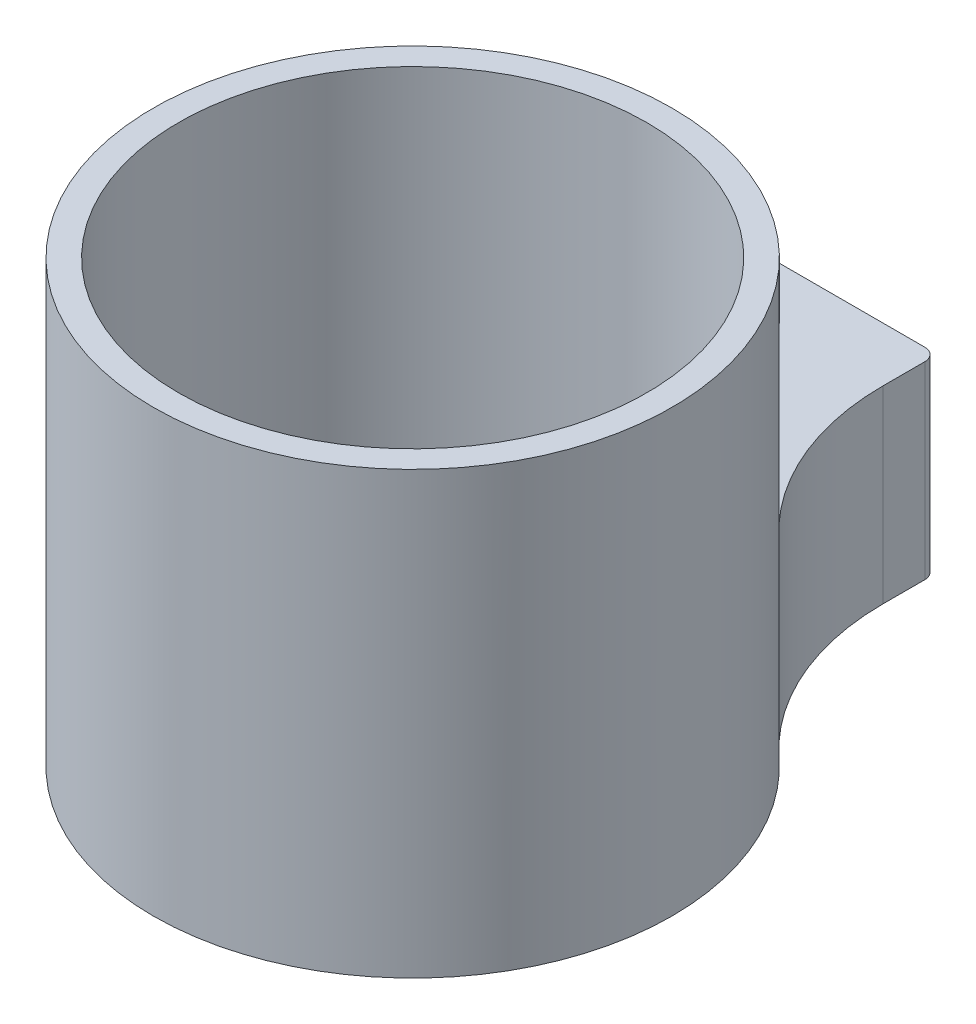
ISO-10303-21;
HEADER;
FILE_DESCRIPTION(('STEP AP214'),'2;1');
FILE_NAME('part.step','',(''),(''),'','','');
FILE_SCHEMA(('AUTOMOTIVE_DESIGN { 1 0 10303 214 1 1 1 1 }'));
ENDSEC;
DATA;
#1=APPLICATION_CONTEXT('core data for automotive mechanical design processes');
#2=APPLICATION_PROTOCOL_DEFINITION('international standard','automotive_design',2000,#1);
#3=PRODUCT_CONTEXT('',#1,'mechanical');
#4=PRODUCT('Part','Part','',(#3));
#5=PRODUCT_RELATED_PRODUCT_CATEGORY('part','',(#4));
#6=PRODUCT_DEFINITION_FORMATION('','',#4);
#7=PRODUCT_DEFINITION_CONTEXT('part definition',#1,'design');
#8=PRODUCT_DEFINITION('design','',#6,#7);
#9=PRODUCT_DEFINITION_SHAPE('','',#8);
#10=(LENGTH_UNIT() NAMED_UNIT(*) SI_UNIT(.MILLI.,.METRE.));
#11=(NAMED_UNIT(*) PLANE_ANGLE_UNIT() SI_UNIT($,.RADIAN.));
#12=(NAMED_UNIT(*) SI_UNIT($,.STERADIAN.) SOLID_ANGLE_UNIT());
#13=UNCERTAINTY_MEASURE_WITH_UNIT(LENGTH_MEASURE(1.E-05),#10,'distance_accuracy_value','');
#14=(GEOMETRIC_REPRESENTATION_CONTEXT(3) GLOBAL_UNCERTAINTY_ASSIGNED_CONTEXT((#13)) GLOBAL_UNIT_ASSIGNED_CONTEXT((#10,
#11,#12)) REPRESENTATION_CONTEXT('',''));
#15=CARTESIAN_POINT('',(0.,0.,0.));
#16=DIRECTION('',(0.,0.,1.));
#17=DIRECTION('',(1.,0.,0.));
#18=AXIS2_PLACEMENT_3D('',#15,#16,#17);
#19=CARTESIAN_POINT('',(7.5,-7.5,15.));
#20=DIRECTION('',(-1.,0.,0.));
#21=DIRECTION('',(0.,0.,1.));
#22=AXIS2_PLACEMENT_3D('',#19,#20,#21);
#23=PLANE('',#22);
#24=DIRECTION('',(0.,0.,-1.));
#25=VECTOR('',#24,1.);
#26=CARTESIAN_POINT('',(7.5,-7.5,15.));
#27=LINE('',#26,#25);
#28=CARTESIAN_POINT('',(7.5,-7.5,4.31798242665095));
#29=VERTEX_POINT('',#28);
#30=CARTESIAN_POINT('',(7.5,-7.5,1.));
#31=VERTEX_POINT('',#30);
#32=EDGE_CURVE('E144',#29,#31,#27,.T.);
#33=ORIENTED_EDGE('',*,*,#32,.T.);
#34=DIRECTION('',(0.,1.,0.));
#35=VECTOR('',#34,1.);
#36=CARTESIAN_POINT('',(7.5,7.5,1.));
#37=LINE('',#36,#35);
#38=CARTESIAN_POINT('',(7.5,7.5,1.));
#39=VERTEX_POINT('',#38);
#40=EDGE_CURVE('E11',#31,#39,#37,.T.);
#41=ORIENTED_EDGE('',*,*,#40,.T.);
#42=DIRECTION('',(0.,0.,-1.));
#43=VECTOR('',#42,1.);
#44=CARTESIAN_POINT('',(7.5,7.5,15.));
#45=LINE('',#44,#43);
#46=CARTESIAN_POINT('',(7.5,7.5,4.31798242665095));
#47=VERTEX_POINT('',#46);
#48=EDGE_CURVE('E156',#47,#39,#45,.T.);
#49=ORIENTED_EDGE('',*,*,#48,.F.);
#50=DIRECTION('',(0.,1.,0.));
#51=VECTOR('',#50,1.);
#52=CARTESIAN_POINT('',(7.5,-7.5,4.31798242665095));
#53=LINE('',#52,#51);
#54=EDGE_CURVE('E170',#47,#29,#53,.F.);
#55=ORIENTED_EDGE('',*,*,#54,.T.);
#56=EDGE_LOOP('',(#33,#41,#49,#55));
#57=FACE_BOUND('',#56,.T.);
#58=ADVANCED_FACE('F46',(#57),#23,.F.);
#59=CARTESIAN_POINT('',(-7.5,7.5,15.));
#60=DIRECTION('',(0.,-1.,0.));
#61=DIRECTION('',(0.,0.,-1.));
#62=AXIS2_PLACEMENT_3D('',#59,#60,#61);
#63=PLANE('',#62);
#64=CARTESIAN_POINT('',(6.,7.5,13.5403701301622));
#65=DIRECTION('',(0.,1.,0.));
#66=DIRECTION('',(0.,0.,1.));
#67=AXIS2_PLACEMENT_3D('',#64,#65,#66);
#68=CIRCLE('',#67,0.499999999999988);
#69=CARTESIAN_POINT('',(6.,7.5,14.0403701301622));
#70=VERTEX_POINT('',#69);
#71=EDGE_CURVE('E316',#70,#70,#68,.T.);
#72=ORIENTED_EDGE('',*,*,#71,.F.);
#73=EDGE_LOOP('',(#72));
#74=FACE_BOUND('',#73,.T.);
#75=DIRECTION('',(-1.,0.,0.));
#76=VECTOR('',#75,1.);
#77=CARTESIAN_POINT('',(-7.5,7.5,0.));
#78=LINE('',#77,#76);
#79=CARTESIAN_POINT('',(6.5,7.5,0.));
#80=VERTEX_POINT('',#79);
#81=CARTESIAN_POINT('',(-6.5,7.5,0.));
#82=VERTEX_POINT('',#81);
#83=EDGE_CURVE('E126',#80,#82,#78,.T.);
#84=ORIENTED_EDGE('',*,*,#83,.T.);
#85=CARTESIAN_POINT('',(-6.5,7.5,1.));
#86=DIRECTION('',(0.,-1.,0.));
#87=DIRECTION('',(0.,0.,-1.));
#88=AXIS2_PLACEMENT_3D('',#85,#86,#87);
#89=CIRCLE('',#88,1.);
#90=CARTESIAN_POINT('',(-7.5,7.5,1.));
#91=VERTEX_POINT('',#90);
#92=EDGE_CURVE('E55',#82,#91,#89,.F.);
#93=ORIENTED_EDGE('',*,*,#92,.T.);
#94=DIRECTION('',(0.,0.,-1.));
#95=VECTOR('',#94,1.);
#96=CARTESIAN_POINT('',(-7.5,7.5,15.));
#97=LINE('',#96,#95);
#98=CARTESIAN_POINT('',(-7.5,7.5,4.31798242665095));
#99=VERTEX_POINT('',#98);
#100=EDGE_CURVE('E152',#99,#91,#97,.T.);
#101=ORIENTED_EDGE('',*,*,#100,.F.);
#102=CARTESIAN_POINT('',(-27.5,7.5,4.31798242665095));
#103=DIRECTION('',(0.,-1.,0.));
#104=DIRECTION('',(0.,0.,-1.));
#105=AXIS2_PLACEMENT_3D('',#102,#103,#104);
#106=CIRCLE('',#105,20.);
#107=CARTESIAN_POINT('',(-13.9532019704434,7.5,19.031386626441));
#108=VERTEX_POINT('',#107);
#109=EDGE_CURVE('E176',#99,#108,#106,.T.);
#110=ORIENTED_EDGE('',*,*,#109,.T.);
#111=CARTESIAN_POINT('',(0.,7.5,34.1861929522248));
#112=DIRECTION('',(0.,-1.,0.));
#113=DIRECTION('',(0.,0.,-1.));
#114=AXIS2_PLACEMENT_3D('',#111,#112,#113);
#115=CIRCLE('',#114,20.6);
#116=CARTESIAN_POINT('',(13.9532019704434,7.5,19.031386626441));
#117=VERTEX_POINT('',#116);
#118=EDGE_CURVE('E137',#108,#117,#115,.T.);
#119=ORIENTED_EDGE('',*,*,#118,.T.);
#120=CARTESIAN_POINT('',(27.5,7.5,4.31798242665095));
#121=DIRECTION('',(0.,-1.,0.));
#122=DIRECTION('',(0.,0.,-1.));
#123=AXIS2_PLACEMENT_3D('',#120,#121,#122);
#124=CIRCLE('',#123,20.);
#125=EDGE_CURVE('E180',#117,#47,#124,.T.);
#126=ORIENTED_EDGE('',*,*,#125,.T.);
#127=ORIENTED_EDGE('',*,*,#48,.T.);
#128=CARTESIAN_POINT('',(6.5,7.5,1.));
#129=DIRECTION('',(0.,-1.,0.));
#130=DIRECTION('',(0.,0.,-1.));
#131=AXIS2_PLACEMENT_3D('',#128,#129,#130);
#132=CIRCLE('',#131,1.);
#133=EDGE_CURVE('E62',#39,#80,#132,.F.);
#134=ORIENTED_EDGE('',*,*,#133,.T.);
#135=EDGE_LOOP('',(#84,#93,#101,#110,#119,#126,#127,#134));
#136=FACE_BOUND('',#135,.T.);
#137=ADVANCED_FACE('F207',(#74,#136),#63,.F.);
#138=CARTESIAN_POINT('',(-7.5,-7.5,15.));
#139=DIRECTION('',(1.,0.,0.));
#140=DIRECTION('',(0.,0.,-1.));
#141=AXIS2_PLACEMENT_3D('',#138,#139,#140);
#142=PLANE('',#141);
#143=ORIENTED_EDGE('',*,*,#100,.T.);
#144=DIRECTION('',(0.,-1.,0.));
#145=VECTOR('',#144,1.);
#146=CARTESIAN_POINT('',(-7.5,-7.5,1.));
#147=LINE('',#146,#145);
#148=CARTESIAN_POINT('',(-7.5,-7.5,1.));
#149=VERTEX_POINT('',#148);
#150=EDGE_CURVE('E185',#91,#149,#147,.T.);
#151=ORIENTED_EDGE('',*,*,#150,.T.);
#152=DIRECTION('',(0.,0.,-1.));
#153=VECTOR('',#152,1.);
#154=CARTESIAN_POINT('',(-7.5,-7.5,15.));
#155=LINE('',#154,#153);
#156=CARTESIAN_POINT('',(-7.5,-7.5,4.31798242665095));
#157=VERTEX_POINT('',#156);
#158=EDGE_CURVE('E148',#157,#149,#155,.T.);
#159=ORIENTED_EDGE('',*,*,#158,.F.);
#160=DIRECTION('',(0.,1.,0.));
#161=VECTOR('',#160,1.);
#162=CARTESIAN_POINT('',(-7.5,-7.5,4.31798242665095));
#163=LINE('',#162,#161);
#164=EDGE_CURVE('E167',#157,#99,#163,.T.);
#165=ORIENTED_EDGE('',*,*,#164,.T.);
#166=EDGE_LOOP('',(#143,#151,#159,#165));
#167=FACE_BOUND('',#166,.T.);
#168=ADVANCED_FACE('F212',(#167),#142,.F.);
#169=CARTESIAN_POINT('',(-7.5,-7.5,15.));
#170=DIRECTION('',(0.,1.,0.));
#171=DIRECTION('',(0.,0.,1.));
#172=AXIS2_PLACEMENT_3D('',#169,#170,#171);
#173=PLANE('',#172);
#174=CARTESIAN_POINT('',(6.,-7.5,13.5403701301622));
#175=DIRECTION('',(0.,1.,0.));
#176=DIRECTION('',(0.,0.,1.));
#177=AXIS2_PLACEMENT_3D('',#174,#175,#176);
#178=CIRCLE('',#177,0.499999999999997);
#179=CARTESIAN_POINT('',(6.,-7.5,14.0403701301622));
#180=VERTEX_POINT('',#179);
#181=EDGE_CURVE('E245',#180,#180,#178,.T.);
#182=ORIENTED_EDGE('',*,*,#181,.T.);
#183=EDGE_LOOP('',(#182));
#184=FACE_BOUND('',#183,.T.);
#185=ORIENTED_EDGE('',*,*,#158,.T.);
#186=CARTESIAN_POINT('',(-6.5,-7.5,1.));
#187=DIRECTION('',(0.,1.,0.));
#188=DIRECTION('',(0.,0.,1.));
#189=AXIS2_PLACEMENT_3D('',#186,#187,#188);
#190=CIRCLE('',#189,1.);
#191=CARTESIAN_POINT('',(-6.5,-7.5,0.));
#192=VERTEX_POINT('',#191);
#193=EDGE_CURVE('E192',#149,#192,#190,.F.);
#194=ORIENTED_EDGE('',*,*,#193,.T.);
#195=DIRECTION('',(1.,0.,0.));
#196=VECTOR('',#195,1.);
#197=CARTESIAN_POINT('',(-7.5,-7.5,0.));
#198=LINE('',#197,#196);
#199=CARTESIAN_POINT('',(6.5,-7.5,0.));
#200=VERTEX_POINT('',#199);
#201=EDGE_CURVE('E133',#192,#200,#198,.T.);
#202=ORIENTED_EDGE('',*,*,#201,.T.);
#203=CARTESIAN_POINT('',(6.5,-7.5,1.));
#204=DIRECTION('',(0.,1.,0.));
#205=DIRECTION('',(0.,0.,1.));
#206=AXIS2_PLACEMENT_3D('',#203,#204,#205);
#207=CIRCLE('',#206,1.);
#208=EDGE_CURVE('E189',#200,#31,#207,.F.);
#209=ORIENTED_EDGE('',*,*,#208,.T.);
#210=ORIENTED_EDGE('',*,*,#32,.F.);
#211=CARTESIAN_POINT('',(27.5,-7.5,4.31798242665095));
#212=DIRECTION('',(0.,1.,0.));
#213=DIRECTION('',(0.,0.,1.));
#214=AXIS2_PLACEMENT_3D('',#211,#212,#213);
#215=CIRCLE('',#214,20.);
#216=CARTESIAN_POINT('',(13.9532019704434,-7.5,19.031386626441));
#217=VERTEX_POINT('',#216);
#218=EDGE_CURVE('E183',#29,#217,#215,.T.);
#219=ORIENTED_EDGE('',*,*,#218,.T.);
#220=CARTESIAN_POINT('',(0.,-7.5,34.1861929522248));
#221=DIRECTION('',(0.,1.,0.));
#222=DIRECTION('',(0.,0.,1.));
#223=AXIS2_PLACEMENT_3D('',#220,#221,#222);
#224=CIRCLE('',#223,20.6);
#225=CARTESIAN_POINT('',(-13.9532019704434,-7.5,19.031386626441));
#226=VERTEX_POINT('',#225);
#227=EDGE_CURVE('E231',#226,#217,#224,.T.);
#228=ORIENTED_EDGE('',*,*,#227,.F.);
#229=CARTESIAN_POINT('',(-27.5,-7.5,4.31798242665095));
#230=DIRECTION('',(0.,1.,0.));
#231=DIRECTION('',(0.,0.,1.));
#232=AXIS2_PLACEMENT_3D('',#229,#230,#231);
#233=CIRCLE('',#232,20.);
#234=EDGE_CURVE('E173',#226,#157,#233,.T.);
#235=ORIENTED_EDGE('',*,*,#234,.T.);
#236=EDGE_LOOP('',(#185,#194,#202,#209,#210,#219,#228,#235));
#237=FACE_BOUND('',#236,.T.);
#238=CARTESIAN_POINT('',(0.,-7.5,34.1861929522248));
#239=DIRECTION('',(0.,1.,0.));
#240=DIRECTION('',(0.,0.,1.));
#241=AXIS2_PLACEMENT_3D('',#238,#239,#240);
#242=CIRCLE('',#241,16.);
#243=CARTESIAN_POINT('',(0.,-7.5,50.1861929522248));
#244=VERTEX_POINT('',#243);
#245=EDGE_CURVE('E236',#244,#244,#242,.T.);
#246=ORIENTED_EDGE('',*,*,#245,.T.);
#247=EDGE_LOOP('',(#246));
#248=FACE_BOUND('',#247,.T.);
#249=ADVANCED_FACE('F217',(#184,#237,#248),#173,.F.);
#250=CARTESIAN_POINT('',(0.,0.,0.));
#251=DIRECTION('',(0.,0.,-1.));
#252=DIRECTION('',(-1.,0.,0.));
#253=AXIS2_PLACEMENT_3D('',#250,#251,#252);
#254=PLANE('',#253);
#255=CARTESIAN_POINT('',(0.,0.,0.));
#256=DIRECTION('',(0.,0.,-1.));
#257=DIRECTION('',(-1.,0.,0.));
#258=AXIS2_PLACEMENT_3D('',#255,#256,#257);
#259=CIRCLE('',#258,3.2);
#260=CARTESIAN_POINT('',(-3.2,0.,0.));
#261=VERTEX_POINT('',#260);
#262=EDGE_CURVE('E127',#261,#261,#259,.T.);
#263=ORIENTED_EDGE('',*,*,#262,.F.);
#264=EDGE_LOOP('',(#263));
#265=FACE_BOUND('',#264,.T.);
#266=ORIENTED_EDGE('',*,*,#201,.F.);
#267=DIRECTION('',(0.,-1.,0.));
#268=VECTOR('',#267,1.);
#269=CARTESIAN_POINT('',(-6.5,7.5,0.));
#270=LINE('',#269,#268);
#271=EDGE_CURVE('E69',#192,#82,#270,.F.);
#272=ORIENTED_EDGE('',*,*,#271,.T.);
#273=ORIENTED_EDGE('',*,*,#83,.F.);
#274=DIRECTION('',(0.,1.,0.));
#275=VECTOR('',#274,1.);
#276=CARTESIAN_POINT('',(6.5,-7.5,0.));
#277=LINE('',#276,#275);
#278=EDGE_CURVE('E195',#80,#200,#277,.F.);
#279=ORIENTED_EDGE('',*,*,#278,.T.);
#280=EDGE_LOOP('',(#266,#272,#273,#279));
#281=FACE_BOUND('',#280,.T.);
#282=ADVANCED_FACE('F119',(#265,#281),#254,.T.);
#283=CARTESIAN_POINT('',(0.,0.,10.));
#284=DIRECTION('',(0.,0.,-1.));
#285=DIRECTION('',(-1.,0.,0.));
#286=AXIS2_PLACEMENT_3D('',#283,#284,#285);
#287=CONICAL_SURFACE('',#286,3.2,1.02974425867665);
#288=CARTESIAN_POINT('',(0.,0.,11.9227539808882));
#289=VERTEX_POINT('',#288);
#290=VERTEX_LOOP('',#289);
#291=FACE_BOUND('',#290,.T.);
#292=CARTESIAN_POINT('',(0.,0.,10.));
#293=DIRECTION('',(0.,0.,-1.));
#294=DIRECTION('',(-1.,0.,0.));
#295=AXIS2_PLACEMENT_3D('',#292,#293,#294);
#296=CIRCLE('',#295,3.2);
#297=CARTESIAN_POINT('',(-3.2,0.,10.));
#298=VERTEX_POINT('',#297);
#299=EDGE_CURVE('E123',#298,#298,#296,.T.);
#300=ORIENTED_EDGE('',*,*,#299,.T.);
#301=EDGE_LOOP('',(#300));
#302=FACE_BOUND('',#301,.T.);
#303=ADVANCED_FACE('F115',(#291,#302),#287,.F.);
#304=CARTESIAN_POINT('',(0.,0.,0.));
#305=DIRECTION('',(0.,0.,-1.));
#306=DIRECTION('',(-1.,0.,0.));
#307=AXIS2_PLACEMENT_3D('',#304,#305,#306);
#308=CYLINDRICAL_SURFACE('',#307,3.2);
#309=ORIENTED_EDGE('',*,*,#299,.F.);
#310=EDGE_LOOP('',(#309));
#311=FACE_BOUND('',#310,.T.);
#312=ORIENTED_EDGE('',*,*,#262,.T.);
#313=EDGE_LOOP('',(#312));
#314=FACE_BOUND('',#313,.T.);
#315=ADVANCED_FACE('F118',(#311,#314),#308,.F.);
#316=CARTESIAN_POINT('',(0.,-2.5,34.1861929522248));
#317=DIRECTION('',(0.,1.,0.));
#318=DIRECTION('',(0.,0.,1.));
#319=AXIS2_PLACEMENT_3D('',#316,#317,#318);
#320=CYLINDRICAL_SURFACE('',#319,20.6);
#321=CARTESIAN_POINT('',(0.,27.5,34.1861929522248));
#322=DIRECTION('',(0.,1.,0.));
#323=DIRECTION('',(0.,0.,1.));
#324=AXIS2_PLACEMENT_3D('',#321,#322,#323);
#325=CIRCLE('',#324,20.6);
#326=CARTESIAN_POINT('',(0.,27.5,54.7861929522248));
#327=VERTEX_POINT('',#326);
#328=EDGE_CURVE('E252',#327,#327,#325,.T.);
#329=ORIENTED_EDGE('',*,*,#328,.F.);
#330=EDGE_LOOP('',(#329));
#331=FACE_BOUND('',#330,.T.);
#332=ORIENTED_EDGE('',*,*,#118,.F.);
#333=DIRECTION('',(0.,1.,0.));
#334=VECTOR('',#333,1.);
#335=CARTESIAN_POINT('',(-13.9532019704434,-2.5,19.031386626441));
#336=LINE('',#335,#334);
#337=EDGE_CURVE('E163',#108,#226,#336,.F.);
#338=ORIENTED_EDGE('',*,*,#337,.T.);
#339=ORIENTED_EDGE('',*,*,#227,.T.);
#340=DIRECTION('',(0.,1.,0.));
#341=VECTOR('',#340,1.);
#342=CARTESIAN_POINT('',(13.9532019704434,-2.5,19.031386626441));
#343=LINE('',#342,#341);
#344=EDGE_CURVE('E159',#217,#117,#343,.T.);
#345=ORIENTED_EDGE('',*,*,#344,.T.);
#346=EDGE_LOOP('',(#332,#338,#339,#345));
#347=FACE_BOUND('',#346,.T.);
#348=ADVANCED_FACE('F233',(#331,#347),#320,.T.);
#349=CARTESIAN_POINT('',(0.,-2.5,34.1861929522248));
#350=DIRECTION('',(0.,1.,0.));
#351=DIRECTION('',(0.,0.,1.));
#352=AXIS2_PLACEMENT_3D('',#349,#350,#351);
#353=CYLINDRICAL_SURFACE('',#352,18.6);
#354=CARTESIAN_POINT('',(0.,-2.5,34.1861929522248));
#355=DIRECTION('',(0.,1.,0.));
#356=DIRECTION('',(0.,0.,1.));
#357=AXIS2_PLACEMENT_3D('',#354,#355,#356);
#358=CIRCLE('',#357,18.6);
#359=CARTESIAN_POINT('',(0.,-2.5,52.7861929522248));
#360=VERTEX_POINT('',#359);
#361=EDGE_CURVE('E256',#360,#360,#358,.T.);
#362=ORIENTED_EDGE('',*,*,#361,.F.);
#363=EDGE_LOOP('',(#362));
#364=FACE_BOUND('',#363,.T.);
#365=CARTESIAN_POINT('',(0.,27.5,34.1861929522248));
#366=DIRECTION('',(0.,1.,0.));
#367=DIRECTION('',(0.,0.,1.));
#368=AXIS2_PLACEMENT_3D('',#365,#366,#367);
#369=CIRCLE('',#368,18.6);
#370=CARTESIAN_POINT('',(0.,27.5,52.7861929522248));
#371=VERTEX_POINT('',#370);
#372=EDGE_CURVE('E242',#371,#371,#369,.T.);
#373=ORIENTED_EDGE('',*,*,#372,.T.);
#374=EDGE_LOOP('',(#373));
#375=FACE_BOUND('',#374,.T.);
#376=ADVANCED_FACE('F292',(#364,#375),#353,.F.);
#377=CARTESIAN_POINT('',(0.,27.5,34.1861929522248));
#378=DIRECTION('',(0.,1.,0.));
#379=DIRECTION('',(0.,0.,1.));
#380=AXIS2_PLACEMENT_3D('',#377,#378,#379);
#381=PLANE('',#380);
#382=ORIENTED_EDGE('',*,*,#328,.T.);
#383=EDGE_LOOP('',(#382));
#384=FACE_BOUND('',#383,.T.);
#385=ORIENTED_EDGE('',*,*,#372,.F.);
#386=EDGE_LOOP('',(#385));
#387=FACE_BOUND('',#386,.T.);
#388=ADVANCED_FACE('F296',(#384,#387),#381,.T.);
#389=CARTESIAN_POINT('',(0.,-2.5,34.1861929522248));
#390=DIRECTION('',(0.,-1.,0.));
#391=DIRECTION('',(0.,0.,-1.));
#392=AXIS2_PLACEMENT_3D('',#389,#390,#391);
#393=PLANE('',#392);
#394=CARTESIAN_POINT('',(0.,-2.5,34.1861929522248));
#395=DIRECTION('',(0.,-1.,0.));
#396=DIRECTION('',(0.,0.,-1.));
#397=AXIS2_PLACEMENT_3D('',#394,#395,#396);
#398=CIRCLE('',#397,16.);
#399=CARTESIAN_POINT('',(0.,-2.5,50.1861929522248));
#400=VERTEX_POINT('',#399);
#401=EDGE_CURVE('E237',#400,#400,#398,.T.);
#402=ORIENTED_EDGE('',*,*,#401,.T.);
#403=EDGE_LOOP('',(#402));
#404=FACE_BOUND('',#403,.T.);
#405=ORIENTED_EDGE('',*,*,#361,.T.);
#406=EDGE_LOOP('',(#405));
#407=FACE_BOUND('',#406,.T.);
#408=ADVANCED_FACE('F270',(#404,#407),#393,.F.);
#409=CARTESIAN_POINT('',(0.,-64.774611737066,34.1861929522248));
#410=DIRECTION('',(0.,1.,0.));
#411=DIRECTION('',(0.,0.,1.));
#412=AXIS2_PLACEMENT_3D('',#409,#410,#411);
#413=CYLINDRICAL_SURFACE('',#412,16.);
#414=CARTESIAN_POINT('',(0.,-7.5,50.1861929522248));
#415=CARTESIAN_POINT('',(0.,-7.44791666666667,50.1861929522248));
#416=CARTESIAN_POINT('',(0.,-7.39583333333333,50.1861929522248));
#417=CARTESIAN_POINT('',(0.,-7.29166666666667,50.1861929522248));
#418=CARTESIAN_POINT('',(0.,-7.23958333333333,50.1861929522248));
#419=CARTESIAN_POINT('',(0.,-7.13541666666667,50.1861929522248));
#420=CARTESIAN_POINT('',(0.,-7.08333333333333,50.1861929522248));
#421=CARTESIAN_POINT('',(0.,-6.97916666666666,50.1861929522248));
#422=CARTESIAN_POINT('',(0.,-6.92708333333333,50.1861929522248));
#423=CARTESIAN_POINT('',(0.,-6.82291666666667,50.1861929522248));
#424=CARTESIAN_POINT('',(0.,-6.77083333333333,50.1861929522248));
#425=CARTESIAN_POINT('',(0.,-6.66666666666667,50.1861929522248));
#426=CARTESIAN_POINT('',(0.,-6.61458333333333,50.1861929522248));
#427=CARTESIAN_POINT('',(0.,-6.51041666666666,50.1861929522248));
#428=CARTESIAN_POINT('',(0.,-6.45833333333333,50.1861929522248));
#429=CARTESIAN_POINT('',(0.,-6.35416666666666,50.1861929522248));
#430=CARTESIAN_POINT('',(0.,-6.30208333333333,50.1861929522248));
#431=CARTESIAN_POINT('',(0.,-6.19791666666667,50.1861929522248));
#432=CARTESIAN_POINT('',(0.,-6.14583333333333,50.1861929522248));
#433=CARTESIAN_POINT('',(0.,-6.04166666666667,50.1861929522248));
#434=CARTESIAN_POINT('',(0.,-5.98958333333333,50.1861929522248));
#435=CARTESIAN_POINT('',(0.,-5.88541666666666,50.1861929522248));
#436=CARTESIAN_POINT('',(0.,-5.83333333333333,50.1861929522248));
#437=CARTESIAN_POINT('',(0.,-5.72916666666666,50.1861929522248));
#438=CARTESIAN_POINT('',(0.,-5.67708333333333,50.1861929522248));
#439=CARTESIAN_POINT('',(0.,-5.57291666666667,50.1861929522248));
#440=CARTESIAN_POINT('',(0.,-5.52083333333333,50.1861929522248));
#441=CARTESIAN_POINT('',(0.,-5.41666666666667,50.1861929522248));
#442=CARTESIAN_POINT('',(0.,-5.36458333333333,50.1861929522248));
#443=CARTESIAN_POINT('',(0.,-5.26041666666666,50.1861929522248));
#444=CARTESIAN_POINT('',(0.,-5.20833333333333,50.1861929522248));
#445=CARTESIAN_POINT('',(0.,-5.10416666666666,50.1861929522248));
#446=CARTESIAN_POINT('',(0.,-5.05208333333333,50.1861929522248));
#447=CARTESIAN_POINT('',(0.,-4.94791666666667,50.1861929522248));
#448=CARTESIAN_POINT('',(0.,-4.89583333333333,50.1861929522248));
#449=CARTESIAN_POINT('',(0.,-4.79166666666667,50.1861929522248));
#450=CARTESIAN_POINT('',(0.,-4.73958333333333,50.1861929522248));
#451=CARTESIAN_POINT('',(0.,-4.63541666666666,50.1861929522248));
#452=CARTESIAN_POINT('',(0.,-4.58333333333333,50.1861929522248));
#453=CARTESIAN_POINT('',(0.,-4.47916666666666,50.1861929522248));
#454=CARTESIAN_POINT('',(0.,-4.42708333333333,50.1861929522248));
#455=CARTESIAN_POINT('',(0.,-4.32291666666667,50.1861929522248));
#456=CARTESIAN_POINT('',(0.,-4.27083333333333,50.1861929522248));
#457=CARTESIAN_POINT('',(0.,-4.16666666666667,50.1861929522248));
#458=CARTESIAN_POINT('',(0.,-4.11458333333333,50.1861929522248));
#459=CARTESIAN_POINT('',(0.,-4.01041666666666,50.1861929522248));
#460=CARTESIAN_POINT('',(0.,-3.95833333333333,50.1861929522248));
#461=CARTESIAN_POINT('',(0.,-3.85416666666666,50.1861929522248));
#462=CARTESIAN_POINT('',(0.,-3.80208333333333,50.1861929522248));
#463=CARTESIAN_POINT('',(0.,-3.69791666666666,50.1861929522248));
#464=CARTESIAN_POINT('',(0.,-3.64583333333333,50.1861929522248));
#465=CARTESIAN_POINT('',(0.,-3.54166666666667,50.1861929522248));
#466=CARTESIAN_POINT('',(0.,-3.48958333333333,50.1861929522248));
#467=CARTESIAN_POINT('',(0.,-3.38541666666666,50.1861929522248));
#468=CARTESIAN_POINT('',(0.,-3.33333333333333,50.1861929522248));
#469=CARTESIAN_POINT('',(0.,-3.22916666666666,50.1861929522248));
#470=CARTESIAN_POINT('',(0.,-3.17708333333333,50.1861929522248));
#471=CARTESIAN_POINT('',(0.,-3.07291666666666,50.1861929522248));
#472=CARTESIAN_POINT('',(0.,-3.02083333333333,50.1861929522248));
#473=CARTESIAN_POINT('',(0.,-2.91666666666666,50.1861929522248));
#474=CARTESIAN_POINT('',(0.,-2.86458333333333,50.1861929522248));
#475=CARTESIAN_POINT('',(0.,-2.76041666666666,50.1861929522248));
#476=CARTESIAN_POINT('',(0.,-2.70833333333333,50.1861929522248));
#477=CARTESIAN_POINT('',(0.,-2.60416666666666,50.1861929522248));
#478=CARTESIAN_POINT('',(0.,-2.55208333333333,50.1861929522248));
#479=CARTESIAN_POINT('',(0.,-2.5,50.1861929522248));
#480=B_SPLINE_CURVE_WITH_KNOTS('',3,(#414,#415,#416,#417,#418,#419,#420,#421,#422,#423,#424,
#425,#426,#427,#428,#429,#430,#431,#432,#433,#434,#435,#436,#437,#438,#439,#440,#441,#442,#443,
#444,#445,#446,#447,#448,#449,#450,#451,#452,#453,#454,#455,#456,#457,#458,#459,#460,#461,#462,
#463,#464,#465,#466,#467,#468,#469,#470,#471,#472,#473,#474,#475,#476,#477,#478,#479),
.UNSPECIFIED.,.F.,.F.,(4,2,2,2,2,2,2,2,2,2,2,2,2,2,2,2,2,2,2,2,2,2,2,2,2,2,2,2,2,2,2,2,4),(0.,
0.156249999999997,0.3125,0.468750000000004,0.625000000000001,0.781249999999997,
0.937500000000001,1.09375,1.25,1.40625,1.5625,1.71875,1.875,2.03125,2.1875,2.34375000000001,2.5,
2.65625,2.8125,2.96875000000001,3.125,3.28125,3.4375,3.59375000000001,3.75,3.90625,4.0625,
4.21875000000001,4.375,4.53125,4.6875,4.84375000000001,5.),.UNSPECIFIED.);
#481=EDGE_CURVE('BSEAM264',#244,#400,#480,.T.);
#482=ORIENTED_EDGE('',*,*,#245,.F.);
#483=ORIENTED_EDGE('',*,*,#401,.F.);
#484=ORIENTED_EDGE('',*,*,#481,.T.);
#485=ORIENTED_EDGE('',*,*,#481,.F.);
#486=EDGE_LOOP('',(#482,#484,#483,#485));
#487=FACE_BOUND('',#486,.T.);
#488=ADVANCED_FACE('F264',(#487),#413,.F.);
#489=CARTESIAN_POINT('',(-27.5,-2.5,4.31798242665095));
#490=DIRECTION('',(0.,1.,0.));
#491=DIRECTION('',(0.,0.,1.));
#492=AXIS2_PLACEMENT_3D('',#489,#490,#491);
#493=CYLINDRICAL_SURFACE('',#492,20.);
#494=ORIENTED_EDGE('',*,*,#109,.F.);
#495=ORIENTED_EDGE('',*,*,#164,.F.);
#496=ORIENTED_EDGE('',*,*,#234,.F.);
#497=ORIENTED_EDGE('',*,*,#337,.F.);
#498=EDGE_LOOP('',(#494,#495,#496,#497));
#499=FACE_BOUND('',#498,.T.);
#500=ADVANCED_FACE('F262',(#499),#493,.F.);
#501=CARTESIAN_POINT('',(27.5,-2.5,4.31798242665095));
#502=DIRECTION('',(0.,1.,0.));
#503=DIRECTION('',(0.,0.,1.));
#504=AXIS2_PLACEMENT_3D('',#501,#502,#503);
#505=CYLINDRICAL_SURFACE('',#504,20.);
#506=ORIENTED_EDGE('',*,*,#218,.F.);
#507=ORIENTED_EDGE('',*,*,#54,.F.);
#508=ORIENTED_EDGE('',*,*,#125,.F.);
#509=ORIENTED_EDGE('',*,*,#344,.F.);
#510=EDGE_LOOP('',(#506,#507,#508,#509));
#511=FACE_BOUND('',#510,.T.);
#512=ADVANCED_FACE('F227',(#511),#505,.F.);
#513=CARTESIAN_POINT('',(-6.5,-7.5,1.));
#514=DIRECTION('',(0.,1.,0.));
#515=DIRECTION('',(0.,0.,1.));
#516=AXIS2_PLACEMENT_3D('',#513,#514,#515);
#517=CYLINDRICAL_SURFACE('',#516,1.);
#518=ORIENTED_EDGE('',*,*,#92,.F.);
#519=ORIENTED_EDGE('',*,*,#271,.F.);
#520=ORIENTED_EDGE('',*,*,#193,.F.);
#521=ORIENTED_EDGE('',*,*,#150,.F.);
#522=EDGE_LOOP('',(#518,#519,#520,#521));
#523=FACE_BOUND('',#522,.T.);
#524=ADVANCED_FACE('F215',(#523),#517,.T.);
#525=CARTESIAN_POINT('',(6.5,-7.5,1.));
#526=DIRECTION('',(0.,-1.,0.));
#527=DIRECTION('',(0.,0.,-1.));
#528=AXIS2_PLACEMENT_3D('',#525,#526,#527);
#529=CYLINDRICAL_SURFACE('',#528,1.);
#530=ORIENTED_EDGE('',*,*,#208,.F.);
#531=ORIENTED_EDGE('',*,*,#278,.F.);
#532=ORIENTED_EDGE('',*,*,#133,.F.);
#533=ORIENTED_EDGE('',*,*,#40,.F.);
#534=EDGE_LOOP('',(#530,#531,#532,#533));
#535=FACE_BOUND('',#534,.T.);
#536=ADVANCED_FACE('F48',(#535),#529,.T.);
#537=CARTESIAN_POINT('',(6.,7.5,13.5403701301622));
#538=DIRECTION('',(0.,1.,0.));
#539=DIRECTION('',(0.,0.,1.));
#540=AXIS2_PLACEMENT_3D('',#537,#538,#539);
#541=CYLINDRICAL_SURFACE('',#540,0.499999999999993);
#542=ORIENTED_EDGE('',*,*,#181,.F.);
#543=EDGE_LOOP('',(#542));
#544=FACE_BOUND('',#543,.T.);
#545=ORIENTED_EDGE('',*,*,#71,.T.);
#546=EDGE_LOOP('',(#545));
#547=FACE_BOUND('',#546,.T.);
#548=ADVANCED_FACE('F304',(#544,#547),#541,.F.);
#549=CLOSED_SHELL('',(#58,#137,#168,#249,#282,#303,#315,#348,#376,#388,#408,#488,#500,#512,#524,
#536,#548));
#550=MANIFOLD_SOLID_BREP('B2',#549);
#551=ADVANCED_BREP_SHAPE_REPRESENTATION('',(#18,#550),#14);
#552=SHAPE_DEFINITION_REPRESENTATION(#9,#551);
ENDSEC;
END-ISO-10303-21;
